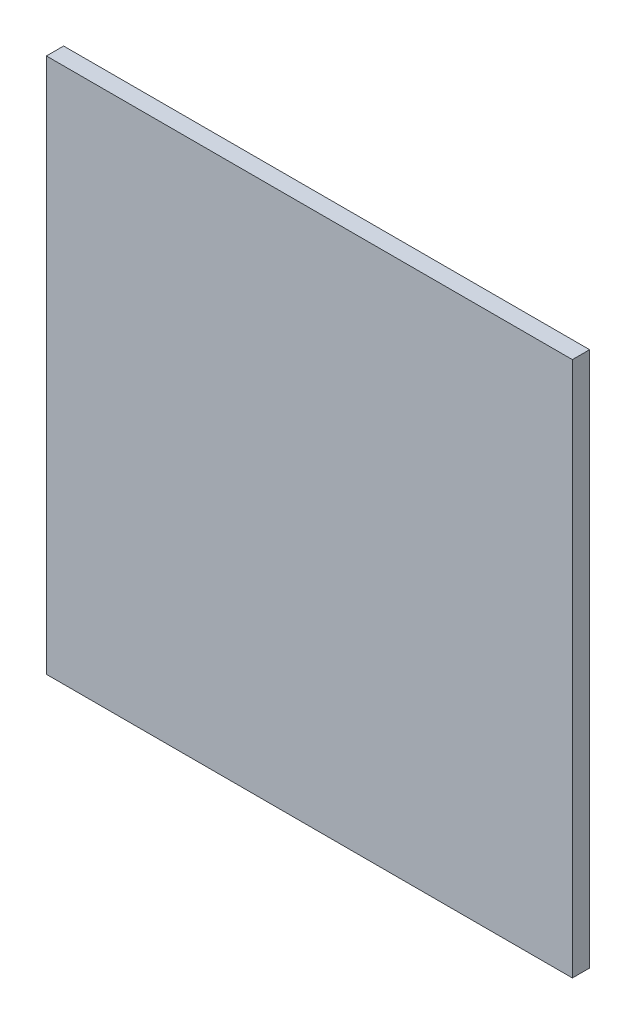
ISO-10303-21;
HEADER;
FILE_DESCRIPTION(('STEP AP214'),'2;1');
FILE_NAME('part.step','',(''),(''),'','','');
FILE_SCHEMA(('AUTOMOTIVE_DESIGN { 1 0 10303 214 1 1 1 1 }'));
ENDSEC;
DATA;
#1=APPLICATION_CONTEXT('core data for automotive mechanical design processes');
#2=APPLICATION_PROTOCOL_DEFINITION('international standard','automotive_design',2000,#1);
#3=PRODUCT_CONTEXT('',#1,'mechanical');
#4=PRODUCT('Part','Part','',(#3));
#5=PRODUCT_RELATED_PRODUCT_CATEGORY('part','',(#4));
#6=PRODUCT_DEFINITION_FORMATION('','',#4);
#7=PRODUCT_DEFINITION_CONTEXT('part definition',#1,'design');
#8=PRODUCT_DEFINITION('design','',#6,#7);
#9=PRODUCT_DEFINITION_SHAPE('','',#8);
#10=(LENGTH_UNIT() NAMED_UNIT(*) SI_UNIT(.MILLI.,.METRE.));
#11=(NAMED_UNIT(*) PLANE_ANGLE_UNIT() SI_UNIT($,.RADIAN.));
#12=(NAMED_UNIT(*) SI_UNIT($,.STERADIAN.) SOLID_ANGLE_UNIT());
#13=UNCERTAINTY_MEASURE_WITH_UNIT(LENGTH_MEASURE(1.E-05),#10,'distance_accuracy_value','');
#14=(GEOMETRIC_REPRESENTATION_CONTEXT(3) GLOBAL_UNCERTAINTY_ASSIGNED_CONTEXT((#13)) GLOBAL_UNIT_ASSIGNED_CONTEXT((#10,
#11,#12)) REPRESENTATION_CONTEXT('',''));
#15=CARTESIAN_POINT('',(0.,0.,0.));
#16=DIRECTION('',(0.,0.,1.));
#17=DIRECTION('',(1.,0.,0.));
#18=AXIS2_PLACEMENT_3D('',#15,#16,#17);
#19=CARTESIAN_POINT('',(-275.,-280.,18.));
#20=DIRECTION('',(1.,0.,0.));
#21=DIRECTION('',(0.,0.,-1.));
#22=AXIS2_PLACEMENT_3D('',#19,#20,#21);
#23=PLANE('',#22);
#24=DIRECTION('',(0.,-1.,0.));
#25=VECTOR('',#24,1.);
#26=CARTESIAN_POINT('',(-275.,-280.,0.));
#27=LINE('',#26,#25);
#28=CARTESIAN_POINT('',(-275.,280.,0.));
#29=VERTEX_POINT('',#28);
#30=CARTESIAN_POINT('',(-275.,-280.,0.));
#31=VERTEX_POINT('',#30);
#32=EDGE_CURVE('E96',#29,#31,#27,.T.);
#33=ORIENTED_EDGE('',*,*,#32,.T.);
#34=DIRECTION('',(0.,0.,-1.));
#35=VECTOR('',#34,1.);
#36=CARTESIAN_POINT('',(-275.,-280.,18.));
#37=LINE('',#36,#35);
#38=CARTESIAN_POINT('',(-275.,-280.,18.));
#39=VERTEX_POINT('',#38);
#40=EDGE_CURVE('E11',#39,#31,#37,.T.);
#41=ORIENTED_EDGE('',*,*,#40,.F.);
#42=DIRECTION('',(0.,-1.,0.));
#43=VECTOR('',#42,1.);
#44=CARTESIAN_POINT('',(-275.,-280.,18.));
#45=LINE('',#44,#43);
#46=CARTESIAN_POINT('',(-275.,280.,18.));
#47=VERTEX_POINT('',#46);
#48=EDGE_CURVE('E84',#47,#39,#45,.T.);
#49=ORIENTED_EDGE('',*,*,#48,.F.);
#50=DIRECTION('',(0.,0.,-1.));
#51=VECTOR('',#50,1.);
#52=CARTESIAN_POINT('',(-275.,280.,18.));
#53=LINE('',#52,#51);
#54=EDGE_CURVE('E92',#47,#29,#53,.T.);
#55=ORIENTED_EDGE('',*,*,#54,.T.);
#56=EDGE_LOOP('',(#33,#41,#49,#55));
#57=FACE_BOUND('',#56,.T.);
#58=ADVANCED_FACE('F33',(#57),#23,.F.);
#59=CARTESIAN_POINT('',(275.,-280.,18.));
#60=DIRECTION('',(0.,1.,0.));
#61=DIRECTION('',(-1.,0.,0.));
#62=AXIS2_PLACEMENT_3D('',#59,#60,#61);
#63=PLANE('',#62);
#64=DIRECTION('',(1.,0.,0.));
#65=VECTOR('',#64,1.);
#66=CARTESIAN_POINT('',(275.,-280.,0.));
#67=LINE('',#66,#65);
#68=CARTESIAN_POINT('',(275.,-280.,0.));
#69=VERTEX_POINT('',#68);
#70=EDGE_CURVE('E88',#31,#69,#67,.T.);
#71=ORIENTED_EDGE('',*,*,#70,.T.);
#72=DIRECTION('',(0.,0.,-1.));
#73=VECTOR('',#72,1.);
#74=CARTESIAN_POINT('',(275.,-280.,18.));
#75=LINE('',#74,#73);
#76=CARTESIAN_POINT('',(275.,-280.,18.));
#77=VERTEX_POINT('',#76);
#78=EDGE_CURVE('E41',#77,#69,#75,.T.);
#79=ORIENTED_EDGE('',*,*,#78,.F.);
#80=DIRECTION('',(1.,0.,0.));
#81=VECTOR('',#80,1.);
#82=CARTESIAN_POINT('',(275.,-280.,18.));
#83=LINE('',#82,#81);
#84=EDGE_CURVE('E79',#39,#77,#83,.T.);
#85=ORIENTED_EDGE('',*,*,#84,.F.);
#86=ORIENTED_EDGE('',*,*,#40,.T.);
#87=EDGE_LOOP('',(#71,#79,#85,#86));
#88=FACE_BOUND('',#87,.T.);
#89=ADVANCED_FACE('F87',(#88),#63,.F.);
#90=CARTESIAN_POINT('',(275.,-280.,18.));
#91=DIRECTION('',(-1.,0.,0.));
#92=DIRECTION('',(0.,0.,1.));
#93=AXIS2_PLACEMENT_3D('',#90,#91,#92);
#94=PLANE('',#93);
#95=DIRECTION('',(0.,1.,0.));
#96=VECTOR('',#95,1.);
#97=CARTESIAN_POINT('',(275.,-280.,0.));
#98=LINE('',#97,#96);
#99=CARTESIAN_POINT('',(275.,280.,0.));
#100=VERTEX_POINT('',#99);
#101=EDGE_CURVE('E66',#69,#100,#98,.T.);
#102=ORIENTED_EDGE('',*,*,#101,.T.);
#103=DIRECTION('',(0.,0.,-1.));
#104=VECTOR('',#103,1.);
#105=CARTESIAN_POINT('',(275.,280.,18.));
#106=LINE('',#105,#104);
#107=CARTESIAN_POINT('',(275.,280.,18.));
#108=VERTEX_POINT('',#107);
#109=EDGE_CURVE('E89',#108,#100,#106,.T.);
#110=ORIENTED_EDGE('',*,*,#109,.F.);
#111=DIRECTION('',(0.,1.,0.));
#112=VECTOR('',#111,1.);
#113=CARTESIAN_POINT('',(275.,-280.,18.));
#114=LINE('',#113,#112);
#115=EDGE_CURVE('E82',#77,#108,#114,.T.);
#116=ORIENTED_EDGE('',*,*,#115,.F.);
#117=ORIENTED_EDGE('',*,*,#78,.T.);
#118=EDGE_LOOP('',(#102,#110,#116,#117));
#119=FACE_BOUND('',#118,.T.);
#120=ADVANCED_FACE('F90',(#119),#94,.F.);
#121=CARTESIAN_POINT('',(275.,280.,18.));
#122=DIRECTION('',(0.,-1.,0.));
#123=DIRECTION('',(1.,0.,0.));
#124=AXIS2_PLACEMENT_3D('',#121,#122,#123);
#125=PLANE('',#124);
#126=DIRECTION('',(-1.,0.,0.));
#127=VECTOR('',#126,1.);
#128=CARTESIAN_POINT('',(275.,280.,0.));
#129=LINE('',#128,#127);
#130=EDGE_CURVE('E72',#100,#29,#129,.T.);
#131=ORIENTED_EDGE('',*,*,#130,.T.);
#132=ORIENTED_EDGE('',*,*,#54,.F.);
#133=DIRECTION('',(-1.,0.,0.));
#134=VECTOR('',#133,1.);
#135=CARTESIAN_POINT('',(275.,280.,18.));
#136=LINE('',#135,#134);
#137=EDGE_CURVE('E49',#108,#47,#136,.T.);
#138=ORIENTED_EDGE('',*,*,#137,.F.);
#139=ORIENTED_EDGE('',*,*,#109,.T.);
#140=EDGE_LOOP('',(#131,#132,#138,#139));
#141=FACE_BOUND('',#140,.T.);
#142=ADVANCED_FACE('F103',(#141),#125,.F.);
#143=CARTESIAN_POINT('',(0.,0.,18.));
#144=DIRECTION('',(0.,0.,1.));
#145=DIRECTION('',(1.,0.,0.));
#146=AXIS2_PLACEMENT_3D('',#143,#144,#145);
#147=PLANE('',#146);
#148=ORIENTED_EDGE('',*,*,#48,.T.);
#149=ORIENTED_EDGE('',*,*,#84,.T.);
#150=ORIENTED_EDGE('',*,*,#115,.T.);
#151=ORIENTED_EDGE('',*,*,#137,.T.);
#152=EDGE_LOOP('',(#148,#149,#150,#151));
#153=FACE_BOUND('',#152,.T.);
#154=ADVANCED_FACE('F80',(#153),#147,.T.);
#155=CARTESIAN_POINT('',(0.,0.,0.));
#156=DIRECTION('',(0.,0.,1.));
#157=DIRECTION('',(1.,0.,0.));
#158=AXIS2_PLACEMENT_3D('',#155,#156,#157);
#159=PLANE('',#158);
#160=ORIENTED_EDGE('',*,*,#32,.F.);
#161=ORIENTED_EDGE('',*,*,#130,.F.);
#162=ORIENTED_EDGE('',*,*,#101,.F.);
#163=ORIENTED_EDGE('',*,*,#70,.F.);
#164=EDGE_LOOP('',(#160,#161,#162,#163));
#165=FACE_BOUND('',#164,.T.);
#166=ADVANCED_FACE('F106',(#165),#159,.F.);
#167=CLOSED_SHELL('',(#58,#89,#120,#142,#154,#166));
#168=MANIFOLD_SOLID_BREP('B2',#167);
#169=ADVANCED_BREP_SHAPE_REPRESENTATION('',(#18,#168),#14);
#170=SHAPE_DEFINITION_REPRESENTATION(#9,#169);
ENDSEC;
END-ISO-10303-21;
